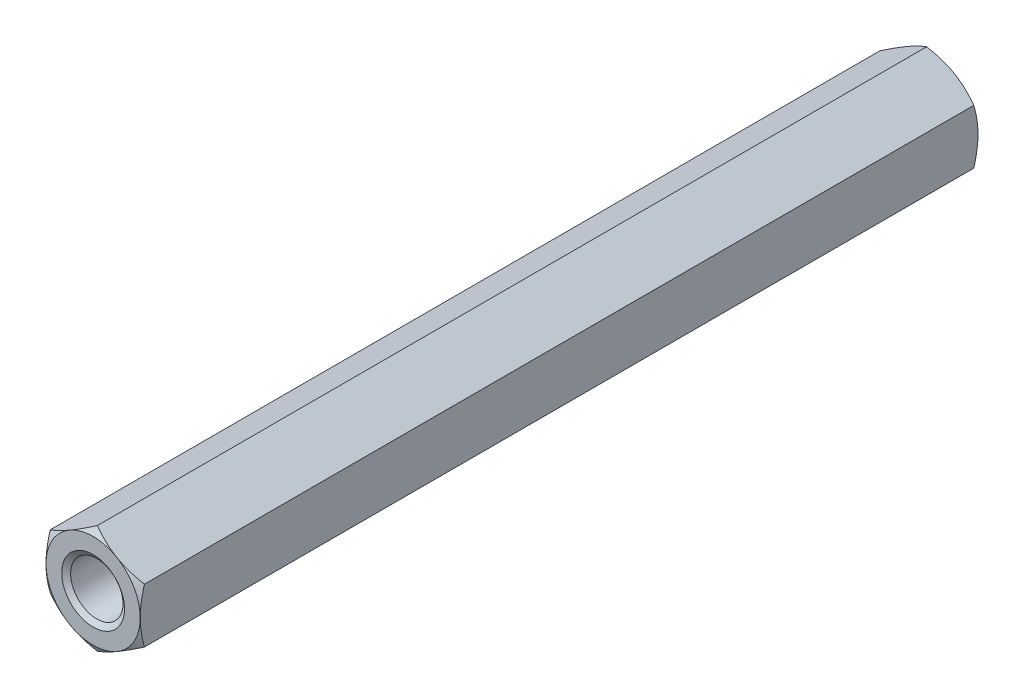
ISO-10303-21;
HEADER;
FILE_DESCRIPTION(('STEP AP214'),'2;1');
FILE_NAME('part.step','',(''),(''),'','','');
FILE_SCHEMA(('AUTOMOTIVE_DESIGN { 1 0 10303 214 1 1 1 1 }'));
ENDSEC;
DATA;
#1=APPLICATION_CONTEXT('core data for automotive mechanical design processes');
#2=APPLICATION_PROTOCOL_DEFINITION('international standard','automotive_design',2000,#1);
#3=PRODUCT_CONTEXT('',#1,'mechanical');
#4=PRODUCT('Part','Part','',(#3));
#5=PRODUCT_RELATED_PRODUCT_CATEGORY('part','',(#4));
#6=PRODUCT_DEFINITION_FORMATION('','',#4);
#7=PRODUCT_DEFINITION_CONTEXT('part definition',#1,'design');
#8=PRODUCT_DEFINITION('design','',#6,#7);
#9=PRODUCT_DEFINITION_SHAPE('','',#8);
#10=(LENGTH_UNIT() NAMED_UNIT(*) SI_UNIT(.MILLI.,.METRE.));
#11=(NAMED_UNIT(*) PLANE_ANGLE_UNIT() SI_UNIT($,.RADIAN.));
#12=(NAMED_UNIT(*) SI_UNIT($,.STERADIAN.) SOLID_ANGLE_UNIT());
#13=UNCERTAINTY_MEASURE_WITH_UNIT(LENGTH_MEASURE(1.E-05),#10,'distance_accuracy_value','');
#14=(GEOMETRIC_REPRESENTATION_CONTEXT(3) GLOBAL_UNCERTAINTY_ASSIGNED_CONTEXT((#13)) GLOBAL_UNIT_ASSIGNED_CONTEXT((#10,
#11,#12)) REPRESENTATION_CONTEXT('',''));
#15=CARTESIAN_POINT('',(0.,0.,0.));
#16=DIRECTION('',(0.,0.,1.));
#17=DIRECTION('',(1.,0.,0.));
#18=AXIS2_PLACEMENT_3D('',#15,#16,#17);
#19=CARTESIAN_POINT('',(0.,0.,-40.));
#20=DIRECTION('',(0.,0.,1.));
#21=DIRECTION('',(1.,0.,0.));
#22=AXIS2_PLACEMENT_3D('',#19,#20,#21);
#23=CYLINDRICAL_SURFACE('',#22,1.25);
#24=CARTESIAN_POINT('',(0.,0.,-0.175051884552426));
#25=DIRECTION('',(0.,0.,1.));
#26=DIRECTION('',(1.,0.,0.));
#27=AXIS2_PLACEMENT_3D('',#24,#25,#26);
#28=CIRCLE('',#27,1.25);
#29=CARTESIAN_POINT('',(1.25,0.,-0.175051884552426));
#30=VERTEX_POINT('',#29);
#31=EDGE_CURVE('E177',#30,#30,#28,.F.);
#32=ORIENTED_EDGE('',*,*,#31,.F.);
#33=EDGE_LOOP('',(#32));
#34=FACE_BOUND('',#33,.T.);
#35=CARTESIAN_POINT('',(0.,0.,-39.7995481154476));
#36=DIRECTION('',(0.,0.,-1.));
#37=DIRECTION('',(-1.,0.,0.));
#38=AXIS2_PLACEMENT_3D('',#35,#36,#37);
#39=CIRCLE('',#38,1.25);
#40=CARTESIAN_POINT('',(-1.25,0.,-39.7995481154476));
#41=VERTEX_POINT('',#40);
#42=EDGE_CURVE('E41',#41,#41,#39,.F.);
#43=ORIENTED_EDGE('',*,*,#42,.F.);
#44=EDGE_LOOP('',(#43));
#45=FACE_BOUND('',#44,.T.);
#46=ADVANCED_FACE('F36',(#34,#45),#23,.F.);
#47=CARTESIAN_POINT('',(0.,2.59807621135332,-40.));
#48=DIRECTION('',(-0.500000000000001,0.866025403784438,0.));
#49=DIRECTION('',(-0.866025403784438,-0.500000000000001,0.));
#50=AXIS2_PLACEMENT_3D('',#47,#48,#49);
#51=PLANE('',#50);
#52=DIRECTION('',(0.,0.,1.));
#53=VECTOR('',#52,1.);
#54=CARTESIAN_POINT('',(-2.25,1.29903810567666,-40.));
#55=LINE('',#54,#53);
#56=CARTESIAN_POINT('',(-2.25,1.29903810567666,-39.7990381056767));
#57=VERTEX_POINT('',#56);
#58=CARTESIAN_POINT('',(-2.25,1.29903810567666,-0.200961894323342));
#59=VERTEX_POINT('',#58);
#60=EDGE_CURVE('E167',#57,#59,#55,.T.);
#61=ORIENTED_EDGE('',*,*,#60,.T.);
#62=CARTESIAN_POINT('',(-2.2502,1.29892263562282,-0.201028565434256));
#63=CARTESIAN_POINT('',(-2.15132275118564,1.35600944184252,-0.168055578047864));
#64=CARTESIAN_POINT('',(-2.05159200282091,1.41358901625738,-0.138067535415598));
#65=CARTESIAN_POINT('',(-1.85040345977937,1.52974527574028,-0.0857223882308766));
#66=CARTESIAN_POINT('',(-1.74894208949705,1.58832402518512,-0.0633838027064767));
#67=CARTESIAN_POINT('',(-1.54727681019892,1.7047555284741,-0.0286095576734163));
#68=CARTESIAN_POINT('',(-1.44710393502333,1.76259036492223,-0.0159424738337157));
#69=CARTESIAN_POINT('',(-1.24628668739732,1.87853225689703,-0.000818907417416252));
#70=CARTESIAN_POINT('',(-1.1456430451668,1.93663889083104,0.00165009697600404));
#71=CARTESIAN_POINT('',(-0.957574835473433,2.04522012232352,-0.00347837463602712));
#72=CARTESIAN_POINT('',(-0.87012215610874,2.09571095029608,-0.00981663451511835));
#73=CARTESIAN_POINT('',(-0.695786567891224,2.19636364908279,-0.0299076571898877));
#74=CARTESIAN_POINT('',(-0.608904262311711,2.24652517159694,-0.0436672872310826));
#75=CARTESIAN_POINT('',(-0.434209045898263,2.34738550181938,-0.0780662653506653));
#76=CARTESIAN_POINT('',(-0.346418252564746,2.39807153998286,-0.0988514715826559));
#77=CARTESIAN_POINT('',(-0.172146263122404,2.49868751999961,-0.146026087362981));
#78=CARTESIAN_POINT('',(-0.0856628332489973,2.54861875151746,-0.172404408014304));
#79=CARTESIAN_POINT('',(0.000199999999999924,2.59819168140716,-0.201028565434258));
#80=B_SPLINE_CURVE_WITH_KNOTS('',3,(#62,#63,#64,#65,#66,#67,#68,#69,#70,#71,#72,#73,#74,#75,#76,
#77,#78,#79),.UNSPECIFIED.,.F.,.F.,(4,2,2,2,2,2,2,2,4),(0.,0.356658826016554,0.714175103224239,
1.06284241804969,1.41108149062516,1.71433394539794,2.01786749258222,2.32813511279246,
2.6377932546036),.UNSPECIFIED.);
#81=CARTESIAN_POINT('',(-1.125,1.94855715851499,0.));
#82=VERTEX_POINT('',#81);
#83=EDGE_CURVE('E63',#59,#82,#80,.T.);
#84=ORIENTED_EDGE('',*,*,#83,.T.);
#85=CARTESIAN_POINT('',(0.,2.59807621135332,-0.200961894323344));
#86=VERTEX_POINT('',#85);
#87=EDGE_CURVE('E246',#82,#86,#80,.T.);
#88=ORIENTED_EDGE('',*,*,#87,.T.);
#89=DIRECTION('',(0.,0.,1.));
#90=VECTOR('',#89,1.);
#91=CARTESIAN_POINT('',(0.,2.59807621135332,-40.));
#92=LINE('',#91,#90);
#93=CARTESIAN_POINT('',(0.,2.59807621135332,-39.7990381056767));
#94=VERTEX_POINT('',#93);
#95=EDGE_CURVE('E152',#94,#86,#92,.T.);
#96=ORIENTED_EDGE('',*,*,#95,.F.);
#97=CARTESIAN_POINT('',(-2.2502,1.29892263562282,-39.7989714345658));
#98=CARTESIAN_POINT('',(-2.15132275118564,1.35600944184252,-39.8319444219521));
#99=CARTESIAN_POINT('',(-2.05159200282091,1.41358901625738,-39.8619324645844));
#100=CARTESIAN_POINT('',(-1.85040345977937,1.52974527574028,-39.9142776117691));
#101=CARTESIAN_POINT('',(-1.74894208949705,1.58832402518512,-39.9366161972935));
#102=CARTESIAN_POINT('',(-1.54727681019892,1.7047555284741,-39.9713904423266));
#103=CARTESIAN_POINT('',(-1.44710393502333,1.76259036492223,-39.9840575261663));
#104=CARTESIAN_POINT('',(-1.24628668739732,1.87853225689703,-39.9991810925826));
#105=CARTESIAN_POINT('',(-1.1456430451668,1.93663889083104,-40.001650096976));
#106=CARTESIAN_POINT('',(-0.957574835473433,2.04522012232352,-39.996521625364));
#107=CARTESIAN_POINT('',(-0.87012215610874,2.09571095029608,-39.9901833654849));
#108=CARTESIAN_POINT('',(-0.695786567891225,2.19636364908279,-39.9700923428101));
#109=CARTESIAN_POINT('',(-0.60890426231171,2.24652517159694,-39.9563327127689));
#110=CARTESIAN_POINT('',(-0.434209045898263,2.34738550181939,-39.9219337346493));
#111=CARTESIAN_POINT('',(-0.346418252564745,2.39807153998286,-39.9011485284174));
#112=CARTESIAN_POINT('',(-0.172146263122404,2.49868751999961,-39.853973912637));
#113=CARTESIAN_POINT('',(-0.0856628332489963,2.54861875151746,-39.8275955919857));
#114=CARTESIAN_POINT('',(0.000200000000001061,2.59819168140716,-39.7989714345657));
#115=B_SPLINE_CURVE_WITH_KNOTS('',3,(#97,#98,#99,#100,#101,#102,#103,#104,#105,#106,#107,#108,
#109,#110,#111,#112,#113,#114),.UNSPECIFIED.,.F.,.F.,(4,2,2,2,2,2,2,2,4),(0.,0.356658826016552,
0.714175103224239,1.06284241804969,1.41108149062516,1.71433394539794,2.01786749258222,
2.32813511279246,2.6377932546036),.UNSPECIFIED.);
#116=CARTESIAN_POINT('',(-1.125,1.94855715851499,-40.));
#117=VERTEX_POINT('',#116);
#118=EDGE_CURVE('E170',#117,#94,#115,.T.);
#119=ORIENTED_EDGE('',*,*,#118,.F.);
#120=EDGE_CURVE('E269',#57,#117,#115,.T.);
#121=ORIENTED_EDGE('',*,*,#120,.F.);
#122=EDGE_LOOP('',(#61,#84,#88,#96,#119,#121));
#123=FACE_BOUND('',#122,.T.);
#124=ADVANCED_FACE('F38',(#123),#51,.T.);
#125=CARTESIAN_POINT('',(2.25,1.29903810567666,-40.));
#126=DIRECTION('',(0.500000000000001,0.866025403784438,0.));
#127=DIRECTION('',(-0.866025403784438,0.500000000000001,0.));
#128=AXIS2_PLACEMENT_3D('',#125,#126,#127);
#129=PLANE('',#128);
#130=ORIENTED_EDGE('',*,*,#95,.T.);
#131=CARTESIAN_POINT('',(-0.000200000000000101,2.59819168140716,-0.201028565434258));
#132=CARTESIAN_POINT('',(0.0986772488143571,2.54110487518746,-0.168055578047866));
#133=CARTESIAN_POINT('',(0.198407997179094,2.48352530077259,-0.138067535415599));
#134=CARTESIAN_POINT('',(0.399596540220634,2.36736904128969,-0.0857223882308779));
#135=CARTESIAN_POINT('',(0.501057910502947,2.30879029184485,-0.063383802706478));
#136=CARTESIAN_POINT('',(0.70272318980108,2.19235878855587,-0.0286095576734172));
#137=CARTESIAN_POINT('',(0.802896064976674,2.13452395210774,-0.0159424738337163));
#138=CARTESIAN_POINT('',(1.00371331260268,2.01858206013295,-0.000818907417416353));
#139=CARTESIAN_POINT('',(1.1043569548332,1.96047542619893,0.00165009697600409));
#140=CARTESIAN_POINT('',(1.29242516452657,1.85189419470646,-0.0034783746360268));
#141=CARTESIAN_POINT('',(1.37987784389126,1.8014033667339,-0.0098166345151179));
#142=CARTESIAN_POINT('',(1.55421343210878,1.70075066794718,-0.0299076571898869));
#143=CARTESIAN_POINT('',(1.64109573768829,1.65058914543303,-0.0436672872310817));
#144=CARTESIAN_POINT('',(1.81579095410174,1.54972881521059,-0.0780662653506642));
#145=CARTESIAN_POINT('',(1.90358174743525,1.49904277704711,-0.0988514715826547));
#146=CARTESIAN_POINT('',(2.0778537368776,1.39842679703036,-0.146026087362979));
#147=CARTESIAN_POINT('',(2.164337166751,1.34849556551251,-0.172404408014303));
#148=CARTESIAN_POINT('',(2.2502,1.29892263562282,-0.201028565434256));
#149=B_SPLINE_CURVE_WITH_KNOTS('',3,(#131,#132,#133,#134,#135,#136,#137,#138,#139,#140,#141,
#142,#143,#144,#145,#146,#147,#148),.UNSPECIFIED.,.F.,.F.,(4,2,2,2,2,2,2,2,4),(0.,
0.356658826016554,0.714175103224239,1.06284241804969,1.41108149062516,1.71433394539794,
2.01786749258222,2.32813511279246,2.6377932546036),.UNSPECIFIED.);
#150=CARTESIAN_POINT('',(1.12500000000001,1.94855715851499,0.));
#151=VERTEX_POINT('',#150);
#152=EDGE_CURVE('E145',#86,#151,#149,.T.);
#153=ORIENTED_EDGE('',*,*,#152,.T.);
#154=CARTESIAN_POINT('',(2.25,1.29903810567666,-0.200961894323344));
#155=VERTEX_POINT('',#154);
#156=EDGE_CURVE('E131',#151,#155,#149,.T.);
#157=ORIENTED_EDGE('',*,*,#156,.T.);
#158=DIRECTION('',(0.,0.,1.));
#159=VECTOR('',#158,1.);
#160=CARTESIAN_POINT('',(2.25,1.29903810567666,-40.));
#161=LINE('',#160,#159);
#162=CARTESIAN_POINT('',(2.25,1.29903810567666,-39.7990381056767));
#163=VERTEX_POINT('',#162);
#164=EDGE_CURVE('E144',#163,#155,#161,.T.);
#165=ORIENTED_EDGE('',*,*,#164,.F.);
#166=CARTESIAN_POINT('',(-0.000200000000000682,2.59819168140716,-39.7989714345657));
#167=CARTESIAN_POINT('',(0.0986772488143563,2.54110487518746,-39.8319444219521));
#168=CARTESIAN_POINT('',(0.198407997179093,2.48352530077259,-39.8619324645844));
#169=CARTESIAN_POINT('',(0.399596540220632,2.36736904128969,-39.9142776117691));
#170=CARTESIAN_POINT('',(0.501057910502946,2.30879029184485,-39.9366161972935));
#171=CARTESIAN_POINT('',(0.70272318980108,2.19235878855587,-39.9713904423266));
#172=CARTESIAN_POINT('',(0.802896064976674,2.13452395210774,-39.9840575261663));
#173=CARTESIAN_POINT('',(1.00371331260268,2.01858206013295,-39.9991810925826));
#174=CARTESIAN_POINT('',(1.1043569548332,1.96047542619893,-40.001650096976));
#175=CARTESIAN_POINT('',(1.29242516452657,1.85189419470646,-39.996521625364));
#176=CARTESIAN_POINT('',(1.37987784389126,1.8014033667339,-39.9901833654849));
#177=CARTESIAN_POINT('',(1.55421343210878,1.70075066794718,-39.9700923428101));
#178=CARTESIAN_POINT('',(1.64109573768829,1.65058914543303,-39.9563327127689));
#179=CARTESIAN_POINT('',(1.81579095410174,1.54972881521059,-39.9219337346493));
#180=CARTESIAN_POINT('',(1.90358174743525,1.49904277704711,-39.9011485284173));
#181=CARTESIAN_POINT('',(2.07785373687759,1.39842679703037,-39.853973912637));
#182=CARTESIAN_POINT('',(2.164337166751,1.34849556551251,-39.8275955919857));
#183=CARTESIAN_POINT('',(2.2502,1.29892263562282,-39.7989714345658));
#184=B_SPLINE_CURVE_WITH_KNOTS('',3,(#166,#167,#168,#169,#170,#171,#172,#173,#174,#175,#176,
#177,#178,#179,#180,#181,#182,#183),.UNSPECIFIED.,.F.,.F.,(4,2,2,2,2,2,2,2,4),(0.,
0.356658826016554,0.71417510322424,1.06284241804969,1.41108149062516,1.71433394539794,
2.01786749258223,2.32813511279246,2.6377932546036),.UNSPECIFIED.);
#185=CARTESIAN_POINT('',(1.12500000000001,1.94855715851499,-40.));
#186=VERTEX_POINT('',#185);
#187=EDGE_CURVE('E262',#186,#163,#184,.T.);
#188=ORIENTED_EDGE('',*,*,#187,.F.);
#189=EDGE_CURVE('E268',#94,#186,#184,.T.);
#190=ORIENTED_EDGE('',*,*,#189,.F.);
#191=EDGE_LOOP('',(#130,#153,#157,#165,#188,#190));
#192=FACE_BOUND('',#191,.T.);
#193=ADVANCED_FACE('F142',(#192),#129,.T.);
#194=CARTESIAN_POINT('',(2.25,1.29903810567666,-40.));
#195=DIRECTION('',(-1.,0.,0.));
#196=DIRECTION('',(0.,0.,1.));
#197=AXIS2_PLACEMENT_3D('',#194,#195,#196);
#198=PLANE('',#197);
#199=CARTESIAN_POINT('',(2.25,-3.44524049435189,-1.07668508694787));
#200=CARTESIAN_POINT('',(2.25,-3.34645277084256,-1.02894540230639));
#201=CARTESIAN_POINT('',(2.25,-3.24743148053599,-0.981680289641675));
#202=CARTESIAN_POINT('',(2.25,-3.048795476876,-0.888370395073417));
#203=CARTESIAN_POINT('',(2.25,-2.9491806643871,-0.842325824456579));
#204=CARTESIAN_POINT('',(2.25,-2.74869321573563,-0.751485635470448));
#205=CARTESIAN_POINT('',(2.25,-2.64781664375266,-0.706698672222968));
#206=CARTESIAN_POINT('',(2.25,-2.44523438295336,-0.619048454298926));
#207=CARTESIAN_POINT('',(2.25,-2.3435287376824,-0.576185099348269));
#208=CARTESIAN_POINT('',(2.25,-2.1378639754405,-0.492384740846835));
#209=CARTESIAN_POINT('',(2.25,-2.03389252212808,-0.451477847371419));
#210=CARTESIAN_POINT('',(2.25,-1.8247232632217,-0.372867879914678));
#211=CARTESIAN_POINT('',(2.25,-1.71952532266388,-0.335165162381162));
#212=CARTESIAN_POINT('',(2.25,-1.50795179017746,-0.263976608492373));
#213=CARTESIAN_POINT('',(2.25,-1.40157924588478,-0.23048180706591));
#214=CARTESIAN_POINT('',(2.25,-1.18732193232666,-0.168796888056285));
#215=CARTESIAN_POINT('',(2.25,-1.07943765291984,-0.140605092943173));
#216=CARTESIAN_POINT('',(2.25,-0.862083183927376,-0.0908948221616475));
#217=CARTESIAN_POINT('',(2.25,-0.75261258017803,-0.0693781233505524));
#218=CARTESIAN_POINT('',(2.25,-0.532351533303312,-0.0344667577063161));
#219=CARTESIAN_POINT('',(2.25,-0.421561089011123,-0.0210720980540783));
#220=CARTESIAN_POINT('',(2.25,-0.199941744165717,-0.00358976989655523));
#221=CARTESIAN_POINT('',(2.25,-0.0891176124903805,0.000556819178088536));
#222=CARTESIAN_POINT('',(2.25,0.132453048154202,-0.000677287335819888));
#223=CARTESIAN_POINT('',(2.25,0.243199589800617,-0.00605550983363237));
#224=CARTESIAN_POINT('',(2.25,0.432315357314353,-0.0229942882201427));
#225=CARTESIAN_POINT('',(2.25,0.510893222839772,-0.0323489790246973));
#226=CARTESIAN_POINT('',(2.25,0.667441963482167,-0.055245043320012));
#227=CARTESIAN_POINT('',(2.25,0.745412740880694,-0.0687870770953738));
#228=CARTESIAN_POINT('',(2.25,0.978350880672943,-0.114983477409502));
#229=CARTESIAN_POINT('',(2.25,1.13222638422405,-0.153196248614145));
#230=CARTESIAN_POINT('',(2.25,1.36247767320668,-0.219102952115923));
#231=CARTESIAN_POINT('',(2.25,1.44005364203364,-0.242839092269041));
#232=CARTESIAN_POINT('',(2.25,1.59439589494538,-0.292660076378112));
#233=CARTESIAN_POINT('',(2.25,1.67116269725749,-0.318743300355133));
#234=CARTESIAN_POINT('',(2.25,1.82356560290439,-0.372715705788906));
#235=CARTESIAN_POINT('',(2.25,1.89920563845094,-0.400593895736338));
#236=CARTESIAN_POINT('',(2.25,2.04989884398511,-0.457986574007264));
#237=CARTESIAN_POINT('',(2.25,2.12495176259652,-0.487501723666889));
#238=CARTESIAN_POINT('',(2.25,2.19973330680007,-0.517673816179752));
#239=B_SPLINE_CURVE_WITH_KNOTS('',3,(#199,#200,#201,#202,#203,#204,#205,#206,#207,#208,#209,
#210,#211,#212,#213,#214,#215,#216,#217,#218,#219,#220,#221,#222,#223,#224,#225,#226,#227,#228,
#229,#230,#231,#232,#233,#234,#235,#236,#237,#238),.UNSPECIFIED.,.F.,.F.,(4,2,2,2,2,2,2,2,2,2,2,
2,2,2,2,2,2,2,2,4),(0.,0.329159133299403,0.658374879712089,0.989474594883693,1.32055703035215,
1.65570413061085,1.99088846556013,2.32534611392401,2.65969778282703,2.99413837725664,
3.32857926737333,3.66088323292896,3.99310092933687,4.23038329214356,4.46770309011097,
4.94269588889903,5.18605471067449,5.42924683377916,5.67107010822919,5.91299180185761),.UNSPECIFIED.);
#240=CARTESIAN_POINT('',(2.25,-1.29903810567666,-0.200961894323344));
#241=VERTEX_POINT('',#240);
#242=CARTESIAN_POINT('',(2.25,0.,0.));
#243=VERTEX_POINT('',#242);
#244=EDGE_CURVE('E137',#241,#243,#239,.T.);
#245=ORIENTED_EDGE('',*,*,#244,.F.);
#246=DIRECTION('',(0.,0.,1.));
#247=VECTOR('',#246,1.);
#248=CARTESIAN_POINT('',(2.25,-1.29903810567666,-40.));
#249=LINE('',#248,#247);
#250=CARTESIAN_POINT('',(2.25,-1.29903810567666,-39.7990381056767));
#251=VERTEX_POINT('',#250);
#252=EDGE_CURVE('E153',#251,#241,#249,.T.);
#253=ORIENTED_EDGE('',*,*,#252,.F.);
#254=CARTESIAN_POINT('',(2.25,-3.44524049435189,-38.9233149130521));
#255=CARTESIAN_POINT('',(2.25,-3.34645277084256,-38.9710545976936));
#256=CARTESIAN_POINT('',(2.25,-3.24743148053599,-39.0183197103583));
#257=CARTESIAN_POINT('',(2.25,-3.04879547687599,-39.1116296049266));
#258=CARTESIAN_POINT('',(2.25,-2.94918066438709,-39.1576741755434));
#259=CARTESIAN_POINT('',(2.25,-2.74869321573563,-39.2485143645295));
#260=CARTESIAN_POINT('',(2.25,-2.64781664375266,-39.293301327777));
#261=CARTESIAN_POINT('',(2.25,-2.44523438295336,-39.3809515457011));
#262=CARTESIAN_POINT('',(2.25,-2.3435287376824,-39.4238149006517));
#263=CARTESIAN_POINT('',(2.25,-2.1378639754405,-39.5076152591532));
#264=CARTESIAN_POINT('',(2.25,-2.03389252212808,-39.5485221526286));
#265=CARTESIAN_POINT('',(2.25,-1.8247232632217,-39.6271321200853));
#266=CARTESIAN_POINT('',(2.25,-1.71952532266388,-39.6648348376188));
#267=CARTESIAN_POINT('',(2.25,-1.50795179017746,-39.7360233915076));
#268=CARTESIAN_POINT('',(2.25,-1.40157924588477,-39.7695181929341));
#269=CARTESIAN_POINT('',(2.25,-1.18732193232666,-39.8312031119437));
#270=CARTESIAN_POINT('',(2.25,-1.07943765291984,-39.8593949070568));
#271=CARTESIAN_POINT('',(2.25,-0.862083183927374,-39.9091051778384));
#272=CARTESIAN_POINT('',(2.25,-0.752612580178028,-39.9306218766494));
#273=CARTESIAN_POINT('',(2.25,-0.532351533303311,-39.9655332422937));
#274=CARTESIAN_POINT('',(2.25,-0.421561089011122,-39.9789279019459));
#275=CARTESIAN_POINT('',(2.25,-0.199941744165717,-39.9964102301034));
#276=CARTESIAN_POINT('',(2.25,-0.0891176124903811,-40.0005568191781));
#277=CARTESIAN_POINT('',(2.25,0.132453048154201,-39.9993227126642));
#278=CARTESIAN_POINT('',(2.25,0.243199589800615,-39.9939444901664));
#279=CARTESIAN_POINT('',(2.25,0.432315357314352,-39.9770057117799));
#280=CARTESIAN_POINT('',(2.25,0.510893222839771,-39.9676510209753));
#281=CARTESIAN_POINT('',(2.25,0.667441963482168,-39.94475495668));
#282=CARTESIAN_POINT('',(2.25,0.745412740880694,-39.9312129229046));
#283=CARTESIAN_POINT('',(2.25,0.978350880672943,-39.8850165225905));
#284=CARTESIAN_POINT('',(2.25,1.13222638422405,-39.8468037513858));
#285=CARTESIAN_POINT('',(2.25,1.36247767320668,-39.7808970478841));
#286=CARTESIAN_POINT('',(2.25,1.44005364203364,-39.757160907731));
#287=CARTESIAN_POINT('',(2.25,1.59439589494538,-39.7073399236219));
#288=CARTESIAN_POINT('',(2.25,1.67116269725749,-39.6812566996449));
#289=CARTESIAN_POINT('',(2.25,1.82356560290439,-39.6272842942111));
#290=CARTESIAN_POINT('',(2.25,1.89920563845094,-39.5994061042637));
#291=CARTESIAN_POINT('',(2.25,2.04989884398511,-39.5420134259927));
#292=CARTESIAN_POINT('',(2.25,2.12495176259652,-39.5124982763331));
#293=CARTESIAN_POINT('',(2.25,2.19973330680006,-39.4823261838202));
#294=B_SPLINE_CURVE_WITH_KNOTS('',3,(#254,#255,#256,#257,#258,#259,#260,#261,#262,#263,#264,
#265,#266,#267,#268,#269,#270,#271,#272,#273,#274,#275,#276,#277,#278,#279,#280,#281,#282,#283,
#284,#285,#286,#287,#288,#289,#290,#291,#292,#293),.UNSPECIFIED.,.F.,.F.,(4,2,2,2,2,2,2,2,2,2,2,
2,2,2,2,2,2,2,2,4),(0.,0.329159133299402,0.658374879712091,0.989474594883692,1.32055703035216,
1.65570413061085,1.99088846556013,2.32534611392401,2.65969778282703,2.99413837725664,
3.32857926737333,3.66088323292896,3.99310092933687,4.23038329214356,4.46770309011097,
4.94269588889903,5.18605471067449,5.42924683377916,5.67107010822919,5.91299180185761),.UNSPECIFIED.);
#295=CARTESIAN_POINT('',(2.25,0.,-40.));
#296=VERTEX_POINT('',#295);
#297=EDGE_CURVE('E275',#251,#296,#294,.T.);
#298=ORIENTED_EDGE('',*,*,#297,.T.);
#299=EDGE_CURVE('E151',#296,#163,#294,.T.);
#300=ORIENTED_EDGE('',*,*,#299,.T.);
#301=ORIENTED_EDGE('',*,*,#164,.T.);
#302=EDGE_CURVE('E128',#243,#155,#239,.T.);
#303=ORIENTED_EDGE('',*,*,#302,.F.);
#304=EDGE_LOOP('',(#245,#253,#298,#300,#301,#303));
#305=FACE_BOUND('',#304,.T.);
#306=ADVANCED_FACE('F148',(#305),#198,.F.);
#307=CARTESIAN_POINT('',(0.,-2.59807621135332,-40.));
#308=DIRECTION('',(0.500000000000001,-0.866025403784438,0.));
#309=DIRECTION('',(0.866025403784438,0.500000000000001,0.));
#310=AXIS2_PLACEMENT_3D('',#307,#308,#309);
#311=PLANE('',#310);
#312=ORIENTED_EDGE('',*,*,#252,.T.);
#313=CARTESIAN_POINT('',(2.2502,-1.29892263562282,-0.201028565434257));
#314=CARTESIAN_POINT('',(2.15132275118564,-1.35600944184252,-0.168055578047866));
#315=CARTESIAN_POINT('',(2.05159200282091,-1.41358901625739,-0.1380675354156));
#316=CARTESIAN_POINT('',(1.85040345977937,-1.52974527574029,-0.0857223882308786));
#317=CARTESIAN_POINT('',(1.74894208949705,-1.58832402518513,-0.0633838027064789));
#318=CARTESIAN_POINT('',(1.54727681019892,-1.70475552847411,-0.0286095576734187));
#319=CARTESIAN_POINT('',(1.44710393502333,-1.76259036492224,-0.0159424738337181));
#320=CARTESIAN_POINT('',(1.24628668739732,-1.87853225689703,-0.000818907417418742));
#321=CARTESIAN_POINT('',(1.1456430451668,-1.93663889083105,0.00165009697600156));
#322=CARTESIAN_POINT('',(0.957574835473432,-2.04522012232352,-0.00347837463602986));
#323=CARTESIAN_POINT('',(0.87012215610874,-2.09571095029608,-0.00981663451512133));
#324=CARTESIAN_POINT('',(0.695786567891224,-2.1963636490828,-0.029907657189891));
#325=CARTESIAN_POINT('',(0.60890426231171,-2.24652517159695,-0.043667287231086));
#326=CARTESIAN_POINT('',(0.434209045898263,-2.34738550181939,-0.0780662653506688));
#327=CARTESIAN_POINT('',(0.346418252564746,-2.39807153998287,-0.0988514715826594));
#328=CARTESIAN_POINT('',(0.172146263122404,-2.49868751999962,-0.146026087362984));
#329=CARTESIAN_POINT('',(0.0856628332489975,-2.54861875151747,-0.172404408014308));
#330=CARTESIAN_POINT('',(-0.000199999999999981,-2.59819168140716,-0.201028565434261));
#331=B_SPLINE_CURVE_WITH_KNOTS('',3,(#313,#314,#315,#316,#317,#318,#319,#320,#321,#322,#323,
#324,#325,#326,#327,#328,#329,#330),.UNSPECIFIED.,.F.,.F.,(4,2,2,2,2,2,2,2,4),(0.,
0.356658826016554,0.714175103224239,1.06284241804969,1.41108149062516,1.71433394539794,
2.01786749258222,2.32813511279246,2.6377932546036),.UNSPECIFIED.);
#332=CARTESIAN_POINT('',(1.12500000000001,-1.94855715851499,0.));
#333=VERTEX_POINT('',#332);
#334=EDGE_CURVE('E550',#241,#333,#331,.T.);
#335=ORIENTED_EDGE('',*,*,#334,.T.);
#336=CARTESIAN_POINT('',(0.,-2.59807621135332,-0.200961894323344));
#337=VERTEX_POINT('',#336);
#338=EDGE_CURVE('E230',#333,#337,#331,.T.);
#339=ORIENTED_EDGE('',*,*,#338,.T.);
#340=DIRECTION('',(0.,0.,1.));
#341=VECTOR('',#340,1.);
#342=CARTESIAN_POINT('',(0.,-2.59807621135332,-40.));
#343=LINE('',#342,#341);
#344=CARTESIAN_POINT('',(0.,-2.59807621135332,-39.7990381056767));
#345=VERTEX_POINT('',#344);
#346=EDGE_CURVE('E158',#345,#337,#343,.T.);
#347=ORIENTED_EDGE('',*,*,#346,.F.);
#348=CARTESIAN_POINT('',(2.2502,-1.29892263562282,-39.7989714345657));
#349=CARTESIAN_POINT('',(2.15132275118564,-1.35600944184252,-39.8319444219521));
#350=CARTESIAN_POINT('',(2.05159200282091,-1.41358901625739,-39.8619324645844));
#351=CARTESIAN_POINT('',(1.85040345977937,-1.52974527574029,-39.9142776117691));
#352=CARTESIAN_POINT('',(1.74894208949706,-1.58832402518513,-39.9366161972935));
#353=CARTESIAN_POINT('',(1.54727681019892,-1.70475552847411,-39.9713904423266));
#354=CARTESIAN_POINT('',(1.44710393502333,-1.76259036492224,-39.9840575261663));
#355=CARTESIAN_POINT('',(1.24628668739732,-1.87853225689703,-39.9991810925826));
#356=CARTESIAN_POINT('',(1.1456430451668,-1.93663889083105,-40.001650096976));
#357=CARTESIAN_POINT('',(0.957574835473433,-2.04522012232352,-39.996521625364));
#358=CARTESIAN_POINT('',(0.87012215610874,-2.09571095029608,-39.9901833654849));
#359=CARTESIAN_POINT('',(0.695786567891224,-2.1963636490828,-39.9700923428101));
#360=CARTESIAN_POINT('',(0.608904262311709,-2.24652517159695,-39.9563327127689));
#361=CARTESIAN_POINT('',(0.434209045898262,-2.34738550181939,-39.9219337346493));
#362=CARTESIAN_POINT('',(0.346418252564744,-2.39807153998287,-39.9011485284173));
#363=CARTESIAN_POINT('',(0.172146263122404,-2.49868751999962,-39.853973912637));
#364=CARTESIAN_POINT('',(0.0856628332489972,-2.54861875151747,-39.8275955919857));
#365=CARTESIAN_POINT('',(-0.000200000000000035,-2.59819168140716,-39.7989714345657));
#366=B_SPLINE_CURVE_WITH_KNOTS('',3,(#348,#349,#350,#351,#352,#353,#354,#355,#356,#357,#358,
#359,#360,#361,#362,#363,#364,#365),.UNSPECIFIED.,.F.,.F.,(4,2,2,2,2,2,2,2,4),(0.,
0.356658826016554,0.714175103224239,1.06284241804969,1.41108149062516,1.71433394539794,
2.01786749258223,2.32813511279246,2.6377932546036),.UNSPECIFIED.);
#367=CARTESIAN_POINT('',(1.12500000000001,-1.94855715851499,-40.));
#368=VERTEX_POINT('',#367);
#369=EDGE_CURVE('E282',#368,#345,#366,.T.);
#370=ORIENTED_EDGE('',*,*,#369,.F.);
#371=EDGE_CURVE('E281',#251,#368,#366,.T.);
#372=ORIENTED_EDGE('',*,*,#371,.F.);
#373=EDGE_LOOP('',(#312,#335,#339,#347,#370,#372));
#374=FACE_BOUND('',#373,.T.);
#375=ADVANCED_FACE('F294',(#374),#311,.T.);
#376=CARTESIAN_POINT('',(-2.25,-1.29903810567666,-40.));
#377=DIRECTION('',(-0.500000000000001,-0.866025403784438,0.));
#378=DIRECTION('',(0.866025403784438,-0.500000000000001,0.));
#379=AXIS2_PLACEMENT_3D('',#376,#377,#378);
#380=PLANE('',#379);
#381=ORIENTED_EDGE('',*,*,#346,.T.);
#382=CARTESIAN_POINT('',(0.0002,-2.59819168140716,-0.201028565434261));
#383=CARTESIAN_POINT('',(-0.0986772488143576,-2.54110487518746,-0.168055578047869));
#384=CARTESIAN_POINT('',(-0.198407997179094,-2.4835253007726,-0.138067535415603));
#385=CARTESIAN_POINT('',(-0.399596540220634,-2.3673690412897,-0.0857223882308809));
#386=CARTESIAN_POINT('',(-0.501057910502948,-2.30879029184485,-0.0633838027064808));
#387=CARTESIAN_POINT('',(-0.702723189801082,-2.19235878855588,-0.02860955767342));
#388=CARTESIAN_POINT('',(-0.802896064976676,-2.13452395210775,-0.0159424738337191));
#389=CARTESIAN_POINT('',(-1.00371331260268,-2.01858206013295,-0.000818907417419217));
#390=CARTESIAN_POINT('',(-1.10435695483321,-1.96047542619893,0.00165009697600132));
#391=CARTESIAN_POINT('',(-1.29242516452657,-1.85189419470646,-0.00347837463602952));
#392=CARTESIAN_POINT('',(-1.37987784389126,-1.8014033667339,-0.0098166345151206));
#393=CARTESIAN_POINT('',(-1.55421343210878,-1.70075066794719,-0.0299076571898896));
#394=CARTESIAN_POINT('',(-1.64109573768829,-1.65058914543304,-0.0436672872310843));
#395=CARTESIAN_POINT('',(-1.81579095410174,-1.54972881521059,-0.0780662653506666));
#396=CARTESIAN_POINT('',(-1.90358174743525,-1.49904277704712,-0.0988514715826568));
#397=CARTESIAN_POINT('',(-2.0778537368776,-1.39842679703037,-0.146026087362981));
#398=CARTESIAN_POINT('',(-2.164337166751,-1.34849556551252,-0.172404408014304));
#399=CARTESIAN_POINT('',(-2.2502,-1.29892263562282,-0.201028565434257));
#400=B_SPLINE_CURVE_WITH_KNOTS('',3,(#382,#383,#384,#385,#386,#387,#388,#389,#390,#391,#392,
#393,#394,#395,#396,#397,#398,#399),.UNSPECIFIED.,.F.,.F.,(4,2,2,2,2,2,2,2,4),(0.,
0.356658826016554,0.714175103224241,1.06284241804969,1.41108149062516,1.71433394539794,
2.01786749258223,2.32813511279246,2.6377932546036),.UNSPECIFIED.);
#401=CARTESIAN_POINT('',(-1.12500000000001,-1.94855715851499,0.));
#402=VERTEX_POINT('',#401);
#403=EDGE_CURVE('E548',#337,#402,#400,.T.);
#404=ORIENTED_EDGE('',*,*,#403,.T.);
#405=CARTESIAN_POINT('',(-2.25,-1.29903810567666,-0.200961894323344));
#406=VERTEX_POINT('',#405);
#407=EDGE_CURVE('E202',#402,#406,#400,.T.);
#408=ORIENTED_EDGE('',*,*,#407,.T.);
#409=DIRECTION('',(0.,0.,1.));
#410=VECTOR('',#409,1.);
#411=CARTESIAN_POINT('',(-2.25,-1.29903810567666,-40.));
#412=LINE('',#411,#410);
#413=CARTESIAN_POINT('',(-2.25,-1.29903810567666,-39.7990381056767));
#414=VERTEX_POINT('',#413);
#415=EDGE_CURVE('E164',#414,#406,#412,.T.);
#416=ORIENTED_EDGE('',*,*,#415,.F.);
#417=CARTESIAN_POINT('',(0.0002,-2.59819168140716,-39.7989714345657));
#418=CARTESIAN_POINT('',(-0.0986772488143582,-2.54110487518746,-39.8319444219521));
#419=CARTESIAN_POINT('',(-0.198407997179095,-2.4835253007726,-39.8619324645844));
#420=CARTESIAN_POINT('',(-0.399596540220635,-2.3673690412897,-39.9142776117691));
#421=CARTESIAN_POINT('',(-0.501057910502948,-2.30879029184485,-39.9366161972935));
#422=CARTESIAN_POINT('',(-0.702723189801082,-2.19235878855588,-39.9713904423266));
#423=CARTESIAN_POINT('',(-0.802896064976676,-2.13452395210775,-39.9840575261663));
#424=CARTESIAN_POINT('',(-1.00371331260268,-2.01858206013295,-39.9991810925826));
#425=CARTESIAN_POINT('',(-1.10435695483321,-1.96047542619893,-40.001650096976));
#426=CARTESIAN_POINT('',(-1.29242516452657,-1.85189419470646,-39.996521625364));
#427=CARTESIAN_POINT('',(-1.37987784389126,-1.8014033667339,-39.9901833654849));
#428=CARTESIAN_POINT('',(-1.55421343210878,-1.70075066794719,-39.9700923428101));
#429=CARTESIAN_POINT('',(-1.64109573768829,-1.65058914543304,-39.9563327127689));
#430=CARTESIAN_POINT('',(-1.81579095410174,-1.54972881521059,-39.9219337346493));
#431=CARTESIAN_POINT('',(-1.90358174743525,-1.49904277704712,-39.9011485284174));
#432=CARTESIAN_POINT('',(-2.0778537368776,-1.39842679703037,-39.853973912637));
#433=CARTESIAN_POINT('',(-2.164337166751,-1.34849556551252,-39.8275955919857));
#434=CARTESIAN_POINT('',(-2.2502,-1.29892263562282,-39.7989714345657));
#435=B_SPLINE_CURVE_WITH_KNOTS('',3,(#417,#418,#419,#420,#421,#422,#423,#424,#425,#426,#427,
#428,#429,#430,#431,#432,#433,#434),.UNSPECIFIED.,.F.,.F.,(4,2,2,2,2,2,2,2,4),(0.,
0.356658826016555,0.71417510322424,1.06284241804969,1.41108149062516,1.71433394539794,
2.01786749258222,2.32813511279246,2.6377932546036),.UNSPECIFIED.);
#436=CARTESIAN_POINT('',(-1.12500000000001,-1.94855715851499,-40.));
#437=VERTEX_POINT('',#436);
#438=EDGE_CURVE('E289',#437,#414,#435,.T.);
#439=ORIENTED_EDGE('',*,*,#438,.F.);
#440=EDGE_CURVE('E288',#345,#437,#435,.T.);
#441=ORIENTED_EDGE('',*,*,#440,.F.);
#442=EDGE_LOOP('',(#381,#404,#408,#416,#439,#441));
#443=FACE_BOUND('',#442,.T.);
#444=ADVANCED_FACE('F297',(#443),#380,.T.);
#445=CARTESIAN_POINT('',(-2.25,1.29903810567666,-40.));
#446=DIRECTION('',(-1.,0.,0.));
#447=DIRECTION('',(0.,0.,1.));
#448=AXIS2_PLACEMENT_3D('',#445,#446,#447);
#449=PLANE('',#448);
#450=ORIENTED_EDGE('',*,*,#415,.T.);
#451=CARTESIAN_POINT('',(-2.25,-3.44524049435189,-1.07668508694787));
#452=CARTESIAN_POINT('',(-2.25,-3.34645277084256,-1.02894540230639));
#453=CARTESIAN_POINT('',(-2.25,-3.24743148053599,-0.981680289641675));
#454=CARTESIAN_POINT('',(-2.25,-3.048795476876,-0.888370395073417));
#455=CARTESIAN_POINT('',(-2.25,-2.9491806643871,-0.842325824456579));
#456=CARTESIAN_POINT('',(-2.25,-2.74869321573563,-0.751485635470448));
#457=CARTESIAN_POINT('',(-2.25,-2.64781664375266,-0.706698672222968));
#458=CARTESIAN_POINT('',(-2.25,-2.44523438295336,-0.619048454298926));
#459=CARTESIAN_POINT('',(-2.25,-2.3435287376824,-0.576185099348269));
#460=CARTESIAN_POINT('',(-2.25,-2.1378639754405,-0.492384740846835));
#461=CARTESIAN_POINT('',(-2.25,-2.03389252212808,-0.451477847371419));
#462=CARTESIAN_POINT('',(-2.25,-1.8247232632217,-0.372867879914678));
#463=CARTESIAN_POINT('',(-2.25,-1.71952532266388,-0.335165162381162));
#464=CARTESIAN_POINT('',(-2.25,-1.50795179017746,-0.263976608492373));
#465=CARTESIAN_POINT('',(-2.25,-1.40157924588478,-0.23048180706591));
#466=CARTESIAN_POINT('',(-2.25,-1.18732193232666,-0.168796888056285));
#467=CARTESIAN_POINT('',(-2.25,-1.07943765291984,-0.140605092943173));
#468=CARTESIAN_POINT('',(-2.25,-0.862083183927376,-0.0908948221616475));
#469=CARTESIAN_POINT('',(-2.25,-0.75261258017803,-0.0693781233505524));
#470=CARTESIAN_POINT('',(-2.25,-0.532351533303312,-0.0344667577063161));
#471=CARTESIAN_POINT('',(-2.25,-0.421561089011123,-0.0210720980540783));
#472=CARTESIAN_POINT('',(-2.25,-0.199941744165717,-0.00358976989655523));
#473=CARTESIAN_POINT('',(-2.25,-0.0891176124903805,0.000556819178088536));
#474=CARTESIAN_POINT('',(-2.25,0.132453048154202,-0.000677287335819888));
#475=CARTESIAN_POINT('',(-2.25,0.243199589800617,-0.00605550983363237));
#476=CARTESIAN_POINT('',(-2.25,0.432315357314353,-0.0229942882201427));
#477=CARTESIAN_POINT('',(-2.25,0.510893222839772,-0.0323489790246973));
#478=CARTESIAN_POINT('',(-2.25,0.667441963482167,-0.055245043320012));
#479=CARTESIAN_POINT('',(-2.25,0.745412740880694,-0.0687870770953738));
#480=CARTESIAN_POINT('',(-2.25,0.978350880672943,-0.114983477409502));
#481=CARTESIAN_POINT('',(-2.25,1.13222638422405,-0.153196248614145));
#482=CARTESIAN_POINT('',(-2.25,1.36247767320668,-0.219102952115923));
#483=CARTESIAN_POINT('',(-2.25,1.44005364203364,-0.242839092269041));
#484=CARTESIAN_POINT('',(-2.25,1.59439589494538,-0.292660076378112));
#485=CARTESIAN_POINT('',(-2.25,1.67116269725749,-0.318743300355133));
#486=CARTESIAN_POINT('',(-2.25,1.82356560290439,-0.372715705788906));
#487=CARTESIAN_POINT('',(-2.25,1.89920563845094,-0.400593895736338));
#488=CARTESIAN_POINT('',(-2.25,2.04989884398511,-0.457986574007264));
#489=CARTESIAN_POINT('',(-2.25,2.12495176259652,-0.487501723666889));
#490=CARTESIAN_POINT('',(-2.25,2.19973330680007,-0.517673816179752));
#491=B_SPLINE_CURVE_WITH_KNOTS('',3,(#451,#452,#453,#454,#455,#456,#457,#458,#459,#460,#461,
#462,#463,#464,#465,#466,#467,#468,#469,#470,#471,#472,#473,#474,#475,#476,#477,#478,#479,#480,
#481,#482,#483,#484,#485,#486,#487,#488,#489,#490),.UNSPECIFIED.,.F.,.F.,(4,2,2,2,2,2,2,2,2,2,2,
2,2,2,2,2,2,2,2,4),(0.,0.329159133299403,0.658374879712089,0.989474594883693,1.32055703035215,
1.65570413061085,1.99088846556013,2.32534611392401,2.65969778282703,2.99413837725664,
3.32857926737333,3.66088323292896,3.99310092933687,4.23038329214356,4.46770309011097,
4.94269588889903,5.18605471067449,5.42924683377916,5.67107010822919,5.91299180185761),.UNSPECIFIED.);
#492=CARTESIAN_POINT('',(-2.25,0.,0.));
#493=VERTEX_POINT('',#492);
#494=EDGE_CURVE('E201',#406,#493,#491,.T.);
#495=ORIENTED_EDGE('',*,*,#494,.T.);
#496=EDGE_CURVE('E194',#493,#59,#491,.T.);
#497=ORIENTED_EDGE('',*,*,#496,.T.);
#498=ORIENTED_EDGE('',*,*,#60,.F.);
#499=CARTESIAN_POINT('',(-2.25,-3.44524049435189,-38.9233149130521));
#500=CARTESIAN_POINT('',(-2.25,-3.34645277084256,-38.9710545976936));
#501=CARTESIAN_POINT('',(-2.25,-3.24743148053599,-39.0183197103583));
#502=CARTESIAN_POINT('',(-2.25,-3.04879547687599,-39.1116296049266));
#503=CARTESIAN_POINT('',(-2.25,-2.94918066438709,-39.1576741755434));
#504=CARTESIAN_POINT('',(-2.25,-2.74869321573563,-39.2485143645295));
#505=CARTESIAN_POINT('',(-2.25,-2.64781664375266,-39.293301327777));
#506=CARTESIAN_POINT('',(-2.25,-2.44523438295336,-39.3809515457011));
#507=CARTESIAN_POINT('',(-2.25,-2.3435287376824,-39.4238149006517));
#508=CARTESIAN_POINT('',(-2.25,-2.1378639754405,-39.5076152591532));
#509=CARTESIAN_POINT('',(-2.25,-2.03389252212808,-39.5485221526286));
#510=CARTESIAN_POINT('',(-2.25,-1.8247232632217,-39.6271321200853));
#511=CARTESIAN_POINT('',(-2.25,-1.71952532266388,-39.6648348376188));
#512=CARTESIAN_POINT('',(-2.25,-1.50795179017746,-39.7360233915076));
#513=CARTESIAN_POINT('',(-2.25,-1.40157924588477,-39.7695181929341));
#514=CARTESIAN_POINT('',(-2.25,-1.18732193232666,-39.8312031119437));
#515=CARTESIAN_POINT('',(-2.25,-1.07943765291984,-39.8593949070568));
#516=CARTESIAN_POINT('',(-2.25,-0.862083183927374,-39.9091051778384));
#517=CARTESIAN_POINT('',(-2.25,-0.752612580178028,-39.9306218766494));
#518=CARTESIAN_POINT('',(-2.25,-0.532351533303311,-39.9655332422937));
#519=CARTESIAN_POINT('',(-2.25,-0.421561089011122,-39.9789279019459));
#520=CARTESIAN_POINT('',(-2.25,-0.199941744165717,-39.9964102301034));
#521=CARTESIAN_POINT('',(-2.25,-0.0891176124903811,-40.0005568191781));
#522=CARTESIAN_POINT('',(-2.25,0.132453048154201,-39.9993227126642));
#523=CARTESIAN_POINT('',(-2.25,0.243199589800615,-39.9939444901664));
#524=CARTESIAN_POINT('',(-2.25,0.432315357314352,-39.9770057117799));
#525=CARTESIAN_POINT('',(-2.25,0.510893222839771,-39.9676510209753));
#526=CARTESIAN_POINT('',(-2.25,0.667441963482168,-39.94475495668));
#527=CARTESIAN_POINT('',(-2.25,0.745412740880694,-39.9312129229046));
#528=CARTESIAN_POINT('',(-2.25,0.978350880672943,-39.8850165225905));
#529=CARTESIAN_POINT('',(-2.25,1.13222638422405,-39.8468037513858));
#530=CARTESIAN_POINT('',(-2.25,1.36247767320668,-39.7808970478841));
#531=CARTESIAN_POINT('',(-2.25,1.44005364203364,-39.757160907731));
#532=CARTESIAN_POINT('',(-2.25,1.59439589494538,-39.7073399236219));
#533=CARTESIAN_POINT('',(-2.25,1.67116269725749,-39.6812566996449));
#534=CARTESIAN_POINT('',(-2.25,1.82356560290439,-39.6272842942111));
#535=CARTESIAN_POINT('',(-2.25,1.89920563845094,-39.5994061042637));
#536=CARTESIAN_POINT('',(-2.25,2.04989884398511,-39.5420134259927));
#537=CARTESIAN_POINT('',(-2.25,2.12495176259652,-39.5124982763331));
#538=CARTESIAN_POINT('',(-2.25,2.19973330680006,-39.4823261838202));
#539=B_SPLINE_CURVE_WITH_KNOTS('',3,(#499,#500,#501,#502,#503,#504,#505,#506,#507,#508,#509,
#510,#511,#512,#513,#514,#515,#516,#517,#518,#519,#520,#521,#522,#523,#524,#525,#526,#527,#528,
#529,#530,#531,#532,#533,#534,#535,#536,#537,#538),.UNSPECIFIED.,.F.,.F.,(4,2,2,2,2,2,2,2,2,2,2,
2,2,2,2,2,2,2,2,4),(0.,0.329159133299402,0.658374879712091,0.989474594883692,1.32055703035216,
1.65570413061085,1.99088846556013,2.32534611392401,2.65969778282703,2.99413837725664,
3.32857926737333,3.66088323292896,3.99310092933687,4.23038329214356,4.46770309011097,
4.94269588889903,5.18605471067449,5.42924683377916,5.67107010822919,5.91299180185761),.UNSPECIFIED.);
#540=CARTESIAN_POINT('',(-2.25,0.,-40.));
#541=VERTEX_POINT('',#540);
#542=EDGE_CURVE('E336',#541,#57,#539,.T.);
#543=ORIENTED_EDGE('',*,*,#542,.F.);
#544=EDGE_CURVE('E351',#414,#541,#539,.T.);
#545=ORIENTED_EDGE('',*,*,#544,.F.);
#546=EDGE_LOOP('',(#450,#495,#497,#498,#543,#545));
#547=FACE_BOUND('',#546,.T.);
#548=ADVANCED_FACE('F209',(#547),#449,.T.);
#549=CARTESIAN_POINT('',(-4.49999999999999,0.,0.));
#550=DIRECTION('',(0.,0.,1.));
#551=DIRECTION('',(1.,0.,0.));
#552=AXIS2_PLACEMENT_3D('',#549,#550,#551);
#553=PLANE('',#552);
#554=CARTESIAN_POINT('',(0.,0.,0.));
#555=DIRECTION('',(0.,0.,1.));
#556=DIRECTION('',(1.,0.,0.));
#557=AXIS2_PLACEMENT_3D('',#554,#555,#556);
#558=CIRCLE('',#557,1.5);
#559=CARTESIAN_POINT('',(1.5,0.,0.));
#560=VERTEX_POINT('',#559);
#561=EDGE_CURVE('E179',#560,#560,#558,.T.);
#562=ORIENTED_EDGE('',*,*,#561,.F.);
#563=EDGE_LOOP('',(#562));
#564=FACE_BOUND('',#563,.T.);
#565=CARTESIAN_POINT('',(0.,0.,0.));
#566=DIRECTION('',(0.,0.,1.));
#567=DIRECTION('',(1.,0.,0.));
#568=AXIS2_PLACEMENT_3D('',#565,#566,#567);
#569=CIRCLE('',#568,2.25);
#570=EDGE_CURVE('E48',#333,#243,#569,.T.);
#571=ORIENTED_EDGE('',*,*,#570,.T.);
#572=CARTESIAN_POINT('',(0.,0.,0.));
#573=DIRECTION('',(0.,0.,1.));
#574=DIRECTION('',(1.,0.,0.));
#575=AXIS2_PLACEMENT_3D('',#572,#573,#574);
#576=CIRCLE('',#575,2.25);
#577=EDGE_CURVE('E55',#243,#151,#576,.T.);
#578=ORIENTED_EDGE('',*,*,#577,.T.);
#579=EDGE_CURVE('E11',#151,#82,#569,.T.);
#580=ORIENTED_EDGE('',*,*,#579,.T.);
#581=EDGE_CURVE('E46',#82,#493,#569,.T.);
#582=ORIENTED_EDGE('',*,*,#581,.T.);
#583=EDGE_CURVE('E372',#493,#402,#569,.T.);
#584=ORIENTED_EDGE('',*,*,#583,.T.);
#585=EDGE_CURVE('E176',#402,#333,#569,.T.);
#586=ORIENTED_EDGE('',*,*,#585,.T.);
#587=EDGE_LOOP('',(#571,#578,#580,#582,#584,#586));
#588=FACE_BOUND('',#587,.T.);
#589=ADVANCED_FACE('F258',(#564,#588),#553,.T.);
#590=CARTESIAN_POINT('',(-4.49999999999999,0.,-40.));
#591=DIRECTION('',(0.,0.,1.));
#592=DIRECTION('',(1.,0.,0.));
#593=AXIS2_PLACEMENT_3D('',#590,#591,#592);
#594=PLANE('',#593);
#595=CARTESIAN_POINT('',(0.,0.,-40.));
#596=DIRECTION('',(0.,0.,1.));
#597=DIRECTION('',(1.,0.,0.));
#598=AXIS2_PLACEMENT_3D('',#595,#596,#597);
#599=CIRCLE('',#598,1.5);
#600=CARTESIAN_POINT('',(1.5,0.,-40.));
#601=VERTEX_POINT('',#600);
#602=EDGE_CURVE('E180',#601,#601,#599,.F.);
#603=ORIENTED_EDGE('',*,*,#602,.F.);
#604=EDGE_LOOP('',(#603));
#605=FACE_BOUND('',#604,.T.);
#606=CARTESIAN_POINT('',(0.,0.,-40.));
#607=DIRECTION('',(0.,0.,1.));
#608=DIRECTION('',(1.,0.,0.));
#609=AXIS2_PLACEMENT_3D('',#606,#607,#608);
#610=CIRCLE('',#609,2.25);
#611=EDGE_CURVE('E253',#296,#186,#610,.T.);
#612=ORIENTED_EDGE('',*,*,#611,.F.);
#613=CARTESIAN_POINT('',(0.,0.,-40.));
#614=DIRECTION('',(0.,0.,1.));
#615=DIRECTION('',(1.,0.,0.));
#616=AXIS2_PLACEMENT_3D('',#613,#614,#615);
#617=CIRCLE('',#616,2.25);
#618=EDGE_CURVE('E171',#296,#368,#617,.F.);
#619=ORIENTED_EDGE('',*,*,#618,.T.);
#620=EDGE_CURVE('E173',#368,#437,#617,.F.);
#621=ORIENTED_EDGE('',*,*,#620,.T.);
#622=EDGE_CURVE('E381',#437,#541,#617,.F.);
#623=ORIENTED_EDGE('',*,*,#622,.T.);
#624=EDGE_CURVE('E364',#541,#117,#617,.F.);
#625=ORIENTED_EDGE('',*,*,#624,.T.);
#626=EDGE_CURVE('E155',#117,#186,#617,.F.);
#627=ORIENTED_EDGE('',*,*,#626,.T.);
#628=EDGE_LOOP('',(#612,#619,#621,#623,#625,#627));
#629=FACE_BOUND('',#628,.T.);
#630=ADVANCED_FACE('F316',(#605,#629),#594,.F.);
#631=CARTESIAN_POINT('',(0.,0.,-40.));
#632=DIRECTION('',(0.,0.,1.));
#633=DIRECTION('',(1.,0.,0.));
#634=AXIS2_PLACEMENT_3D('',#631,#632,#633);
#635=CONICAL_SURFACE('',#634,2.25,1.04719755119659);
#636=ORIENTED_EDGE('',*,*,#187,.T.);
#637=ORIENTED_EDGE('',*,*,#299,.F.);
#638=ORIENTED_EDGE('',*,*,#611,.T.);
#639=EDGE_LOOP('',(#636,#637,#638));
#640=FACE_BOUND('',#639,.T.);
#641=ADVANCED_FACE('F318',(#640),#635,.T.);
#642=ORIENTED_EDGE('',*,*,#118,.T.);
#643=ORIENTED_EDGE('',*,*,#189,.T.);
#644=ORIENTED_EDGE('',*,*,#626,.F.);
#645=EDGE_LOOP('',(#642,#643,#644));
#646=FACE_BOUND('',#645,.T.);
#647=ADVANCED_FACE('F324',(#646),#635,.T.);
#648=ORIENTED_EDGE('',*,*,#120,.T.);
#649=ORIENTED_EDGE('',*,*,#624,.F.);
#650=ORIENTED_EDGE('',*,*,#542,.T.);
#651=EDGE_LOOP('',(#648,#649,#650));
#652=FACE_BOUND('',#651,.T.);
#653=ADVANCED_FACE('F363',(#652),#635,.T.);
#654=ORIENTED_EDGE('',*,*,#438,.T.);
#655=ORIENTED_EDGE('',*,*,#544,.T.);
#656=ORIENTED_EDGE('',*,*,#622,.F.);
#657=EDGE_LOOP('',(#654,#655,#656));
#658=FACE_BOUND('',#657,.T.);
#659=ADVANCED_FACE('F222',(#658),#635,.T.);
#660=ORIENTED_EDGE('',*,*,#369,.T.);
#661=ORIENTED_EDGE('',*,*,#440,.T.);
#662=ORIENTED_EDGE('',*,*,#620,.F.);
#663=EDGE_LOOP('',(#660,#661,#662));
#664=FACE_BOUND('',#663,.T.);
#665=ADVANCED_FACE('F346',(#664),#635,.T.);
#666=ORIENTED_EDGE('',*,*,#371,.T.);
#667=ORIENTED_EDGE('',*,*,#618,.F.);
#668=ORIENTED_EDGE('',*,*,#297,.F.);
#669=EDGE_LOOP('',(#666,#667,#668));
#670=FACE_BOUND('',#669,.T.);
#671=ADVANCED_FACE('F326',(#670),#635,.T.);
#672=CARTESIAN_POINT('',(0.,0.,0.));
#673=DIRECTION('',(0.,0.,-1.));
#674=DIRECTION('',(-1.,0.,0.));
#675=AXIS2_PLACEMENT_3D('',#672,#673,#674);
#676=CONICAL_SURFACE('',#675,2.25,1.04719755119659);
#677=ORIENTED_EDGE('',*,*,#244,.T.);
#678=ORIENTED_EDGE('',*,*,#570,.F.);
#679=ORIENTED_EDGE('',*,*,#334,.F.);
#680=EDGE_LOOP('',(#677,#678,#679));
#681=FACE_BOUND('',#680,.T.);
#682=ADVANCED_FACE('F415',(#681),#676,.T.);
#683=ORIENTED_EDGE('',*,*,#585,.F.);
#684=ORIENTED_EDGE('',*,*,#403,.F.);
#685=ORIENTED_EDGE('',*,*,#338,.F.);
#686=EDGE_LOOP('',(#683,#684,#685));
#687=FACE_BOUND('',#686,.T.);
#688=ADVANCED_FACE('F217',(#687),#676,.T.);
#689=ORIENTED_EDGE('',*,*,#583,.F.);
#690=ORIENTED_EDGE('',*,*,#494,.F.);
#691=ORIENTED_EDGE('',*,*,#407,.F.);
#692=EDGE_LOOP('',(#689,#690,#691));
#693=FACE_BOUND('',#692,.T.);
#694=ADVANCED_FACE('F211',(#693),#676,.T.);
#695=ORIENTED_EDGE('',*,*,#496,.F.);
#696=ORIENTED_EDGE('',*,*,#581,.F.);
#697=ORIENTED_EDGE('',*,*,#83,.F.);
#698=EDGE_LOOP('',(#695,#696,#697));
#699=FACE_BOUND('',#698,.T.);
#700=ADVANCED_FACE('F216',(#699),#676,.T.);
#701=ORIENTED_EDGE('',*,*,#579,.F.);
#702=ORIENTED_EDGE('',*,*,#152,.F.);
#703=ORIENTED_EDGE('',*,*,#87,.F.);
#704=EDGE_LOOP('',(#701,#702,#703));
#705=FACE_BOUND('',#704,.T.);
#706=ADVANCED_FACE('F219',(#705),#676,.T.);
#707=ORIENTED_EDGE('',*,*,#577,.F.);
#708=ORIENTED_EDGE('',*,*,#302,.T.);
#709=ORIENTED_EDGE('',*,*,#156,.F.);
#710=EDGE_LOOP('',(#707,#708,#709));
#711=FACE_BOUND('',#710,.T.);
#712=ADVANCED_FACE('F130',(#711),#676,.T.);
#713=CARTESIAN_POINT('',(0.,0.,-0.192557073007669));
#714=DIRECTION('',(0.,0.,1.));
#715=DIRECTION('',(1.,0.,0.));
#716=AXIS2_PLACEMENT_3D('',#713,#714,#715);
#717=CONICAL_SURFACE('',#716,1.225,0.959931088596885);
#718=ORIENTED_EDGE('',*,*,#561,.T.);
#719=EDGE_LOOP('',(#718));
#720=FACE_BOUND('',#719,.T.);
#721=ORIENTED_EDGE('',*,*,#31,.T.);
#722=EDGE_LOOP('',(#721));
#723=FACE_BOUND('',#722,.T.);
#724=ADVANCED_FACE('F220',(#720,#723),#717,.F.);
#725=CARTESIAN_POINT('',(0.,0.,-39.9746));
#726=DIRECTION('',(0.,0.,-1.));
#727=DIRECTION('',(-1.,0.,0.));
#728=AXIS2_PLACEMENT_3D('',#725,#726,#727);
#729=CONICAL_SURFACE('',#728,1.50000000000001,0.959931088596876);
#730=CARTESIAN_POINT('',(0.,0.,-39.9746));
#731=DIRECTION('',(0.,0.,1.));
#732=DIRECTION('',(1.,0.,0.));
#733=AXIS2_PLACEMENT_3D('',#730,#731,#732);
#734=CIRCLE('',#733,1.50000000000001);
#735=CARTESIAN_POINT('',(1.50000000000001,0.,-39.9746));
#736=VERTEX_POINT('',#735);
#737=EDGE_CURVE('E182',#736,#736,#734,.T.);
#738=ORIENTED_EDGE('',*,*,#737,.F.);
#739=EDGE_LOOP('',(#738));
#740=FACE_BOUND('',#739,.T.);
#741=ORIENTED_EDGE('',*,*,#42,.T.);
#742=EDGE_LOOP('',(#741));
#743=FACE_BOUND('',#742,.T.);
#744=ADVANCED_FACE('F483',(#740,#743),#729,.F.);
#745=CARTESIAN_POINT('',(0.,0.,-25.0375057290932));
#746=DIRECTION('',(0.,0.,1.));
#747=DIRECTION('',(1.,0.,0.));
#748=AXIS2_PLACEMENT_3D('',#745,#746,#747);
#749=CYLINDRICAL_SURFACE('',#748,1.5);
#750=ORIENTED_EDGE('',*,*,#737,.T.);
#751=EDGE_LOOP('',(#750));
#752=FACE_BOUND('',#751,.T.);
#753=ORIENTED_EDGE('',*,*,#602,.T.);
#754=EDGE_LOOP('',(#753));
#755=FACE_BOUND('',#754,.T.);
#756=ADVANCED_FACE('F492',(#752,#755),#749,.F.);
#757=CLOSED_SHELL('',(#46,#124,#193,#306,#375,#444,#548,#589,#630,#641,#647,#653,#659,#665,#671,
#682,#688,#694,#700,#706,#712,#724,#744,#756));
#758=MANIFOLD_SOLID_BREP('B2',#757);
#759=ADVANCED_BREP_SHAPE_REPRESENTATION('',(#18,#758),#14);
#760=SHAPE_DEFINITION_REPRESENTATION(#9,#759);
ENDSEC;
END-ISO-10303-21;
